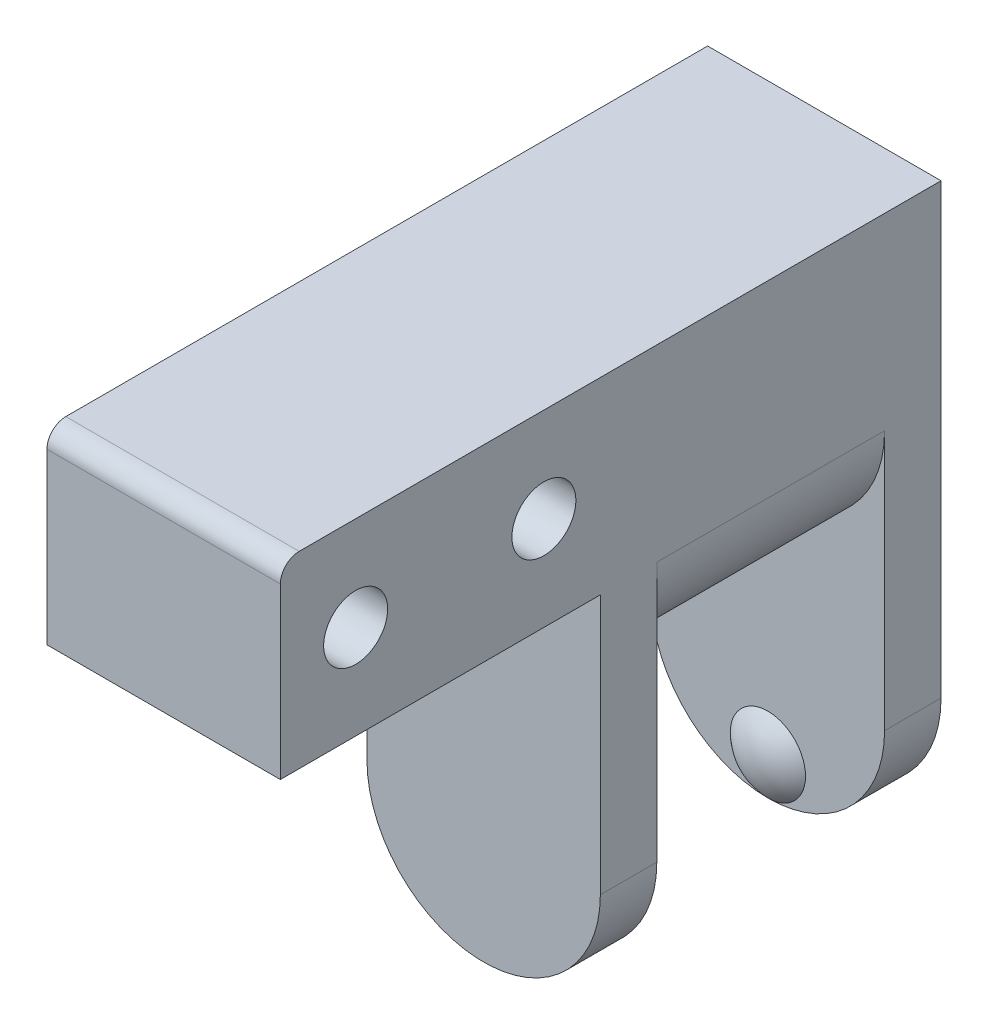
ISO-10303-21;
HEADER;
FILE_DESCRIPTION(('STEP AP214'),'2;1');
FILE_NAME('part.step','',(''),(''),'','','');
FILE_SCHEMA(('AUTOMOTIVE_DESIGN { 1 0 10303 214 1 1 1 1 }'));
ENDSEC;
DATA;
#1=APPLICATION_CONTEXT('core data for automotive mechanical design processes');
#2=APPLICATION_PROTOCOL_DEFINITION('international standard','automotive_design',2000,#1);
#3=PRODUCT_CONTEXT('',#1,'mechanical');
#4=PRODUCT('Part','Part','',(#3));
#5=PRODUCT_RELATED_PRODUCT_CATEGORY('part','',(#4));
#6=PRODUCT_DEFINITION_FORMATION('','',#4);
#7=PRODUCT_DEFINITION_CONTEXT('part definition',#1,'design');
#8=PRODUCT_DEFINITION('design','',#6,#7);
#9=PRODUCT_DEFINITION_SHAPE('','',#8);
#10=(LENGTH_UNIT() NAMED_UNIT(*) SI_UNIT(.MILLI.,.METRE.));
#11=(NAMED_UNIT(*) PLANE_ANGLE_UNIT() SI_UNIT($,.RADIAN.));
#12=(NAMED_UNIT(*) SI_UNIT($,.STERADIAN.) SOLID_ANGLE_UNIT());
#13=UNCERTAINTY_MEASURE_WITH_UNIT(LENGTH_MEASURE(1.E-05),#10,'distance_accuracy_value','');
#14=(GEOMETRIC_REPRESENTATION_CONTEXT(3) GLOBAL_UNCERTAINTY_ASSIGNED_CONTEXT((#13)) GLOBAL_UNIT_ASSIGNED_CONTEXT((#10,
#11,#12)) REPRESENTATION_CONTEXT('',''));
#15=CARTESIAN_POINT('',(0.,0.,0.));
#16=DIRECTION('',(0.,0.,1.));
#17=DIRECTION('',(1.,0.,0.));
#18=AXIS2_PLACEMENT_3D('',#15,#16,#17);
#19=CARTESIAN_POINT('',(12.4,0.,-12.1));
#20=DIRECTION('',(0.,0.,-1.));
#21=DIRECTION('',(0.,1.,0.));
#22=AXIS2_PLACEMENT_3D('',#19,#20,#21);
#23=PLANE('',#22);
#24=CARTESIAN_POINT('',(6.2,-13.8,-12.1));
#25=DIRECTION('',(0.,0.,-1.));
#26=DIRECTION('',(0.,1.,0.));
#27=AXIS2_PLACEMENT_3D('',#24,#25,#26);
#28=CIRCLE('',#27,6.2);
#29=CARTESIAN_POINT('',(0.,-13.8,-12.1));
#30=VERTEX_POINT('',#29);
#31=CARTESIAN_POINT('',(6.2,-20.,-12.1));
#32=VERTEX_POINT('',#31);
#33=EDGE_CURVE('E136',#30,#32,#28,.F.);
#34=ORIENTED_EDGE('',*,*,#33,.T.);
#35=CARTESIAN_POINT('',(6.2,-18.,-12.1));
#36=DIRECTION('',(0.,0.,1.));
#37=DIRECTION('',(1.,0.,0.));
#38=AXIS2_PLACEMENT_3D('',#35,#36,#37);
#39=CIRCLE('',#38,2.);
#40=EDGE_CURVE('E265',#32,#32,#39,.T.);
#41=ORIENTED_EDGE('',*,*,#40,.F.);
#42=CARTESIAN_POINT('',(12.4,-13.8,-12.1));
#43=VERTEX_POINT('',#42);
#44=EDGE_CURVE('E248',#32,#43,#28,.F.);
#45=ORIENTED_EDGE('',*,*,#44,.T.);
#46=DIRECTION('',(0.,-1.,0.));
#47=VECTOR('',#46,1.);
#48=CARTESIAN_POINT('',(12.4,0.,-12.1));
#49=LINE('',#48,#47);
#50=CARTESIAN_POINT('',(12.4,0.,-12.1));
#51=VERTEX_POINT('',#50);
#52=EDGE_CURVE('E177',#51,#43,#49,.T.);
#53=ORIENTED_EDGE('',*,*,#52,.F.);
#54=CARTESIAN_POINT('',(6.2,0.,-12.1));
#55=DIRECTION('',(0.,0.,-1.));
#56=DIRECTION('',(0.,1.,0.));
#57=AXIS2_PLACEMENT_3D('',#54,#55,#56);
#58=CIRCLE('',#57,6.2);
#59=CARTESIAN_POINT('',(0.,0.,-12.1));
#60=VERTEX_POINT('',#59);
#61=EDGE_CURVE('E234',#51,#60,#58,.T.);
#62=ORIENTED_EDGE('',*,*,#61,.T.);
#63=DIRECTION('',(0.,-1.,0.));
#64=VECTOR('',#63,1.);
#65=CARTESIAN_POINT('',(0.,0.,-12.1));
#66=LINE('',#65,#64);
#67=EDGE_CURVE('E155',#60,#30,#66,.T.);
#68=ORIENTED_EDGE('',*,*,#67,.T.);
#69=EDGE_LOOP('',(#34,#41,#45,#53,#62,#68));
#70=FACE_BOUND('',#69,.T.);
#71=ADVANCED_FACE('F42',(#70),#23,.F.);
#72=CARTESIAN_POINT('',(12.4,0.,-15.1));
#73=DIRECTION('',(0.,0.,1.));
#74=DIRECTION('',(0.,-1.,0.));
#75=AXIS2_PLACEMENT_3D('',#72,#73,#74);
#76=PLANE('',#75);
#77=DIRECTION('',(0.,1.,0.));
#78=VECTOR('',#77,1.);
#79=CARTESIAN_POINT('',(12.4,0.,-15.1));
#80=LINE('',#79,#78);
#81=CARTESIAN_POINT('',(12.4,-13.8,-15.1));
#82=VERTEX_POINT('',#81);
#83=CARTESIAN_POINT('',(12.4,10.,-15.1));
#84=VERTEX_POINT('',#83);
#85=EDGE_CURVE('E148',#82,#84,#80,.T.);
#86=ORIENTED_EDGE('',*,*,#85,.F.);
#87=CARTESIAN_POINT('',(6.2,-13.8,-15.1));
#88=DIRECTION('',(0.,0.,-1.));
#89=DIRECTION('',(1.,0.,0.));
#90=AXIS2_PLACEMENT_3D('',#87,#88,#89);
#91=CIRCLE('',#90,6.2);
#92=CARTESIAN_POINT('',(0.,-13.8,-15.1));
#93=VERTEX_POINT('',#92);
#94=EDGE_CURVE('E132',#82,#93,#91,.T.);
#95=ORIENTED_EDGE('',*,*,#94,.T.);
#96=DIRECTION('',(0.,1.,0.));
#97=VECTOR('',#96,1.);
#98=CARTESIAN_POINT('',(0.,0.,-15.1));
#99=LINE('',#98,#97);
#100=CARTESIAN_POINT('',(0.,10.,-15.1));
#101=VERTEX_POINT('',#100);
#102=EDGE_CURVE('E146',#93,#101,#99,.T.);
#103=ORIENTED_EDGE('',*,*,#102,.T.);
#104=DIRECTION('',(-1.,0.,0.));
#105=VECTOR('',#104,1.);
#106=CARTESIAN_POINT('',(12.4,10.,-15.1));
#107=LINE('',#106,#105);
#108=EDGE_CURVE('E187',#84,#101,#107,.T.);
#109=ORIENTED_EDGE('',*,*,#108,.F.);
#110=EDGE_LOOP('',(#86,#95,#103,#109));
#111=FACE_BOUND('',#110,.T.);
#112=ADVANCED_FACE('F144',(#111),#76,.F.);
#113=CARTESIAN_POINT('',(12.4,0.,3.));
#114=DIRECTION('',(0.,0.,-1.));
#115=DIRECTION('',(0.,1.,0.));
#116=AXIS2_PLACEMENT_3D('',#113,#114,#115);
#117=PLANE('',#116);
#118=DIRECTION('',(0.,-1.,0.));
#119=VECTOR('',#118,1.);
#120=CARTESIAN_POINT('',(0.,0.,3.));
#121=LINE('',#120,#119);
#122=CARTESIAN_POINT('',(0.,0.,3.));
#123=VERTEX_POINT('',#122);
#124=CARTESIAN_POINT('',(0.,-13.8,3.));
#125=VERTEX_POINT('',#124);
#126=EDGE_CURVE('E170',#123,#125,#121,.T.);
#127=ORIENTED_EDGE('',*,*,#126,.T.);
#128=CARTESIAN_POINT('',(6.2,-13.8,3.));
#129=DIRECTION('',(0.,0.,-1.));
#130=DIRECTION('',(0.,1.,0.));
#131=AXIS2_PLACEMENT_3D('',#128,#129,#130);
#132=CIRCLE('',#131,6.2);
#133=CARTESIAN_POINT('',(12.4,-13.8,3.));
#134=VERTEX_POINT('',#133);
#135=EDGE_CURVE('E249',#125,#134,#132,.F.);
#136=ORIENTED_EDGE('',*,*,#135,.T.);
#137=DIRECTION('',(0.,-1.,0.));
#138=VECTOR('',#137,1.);
#139=CARTESIAN_POINT('',(12.4,0.,3.));
#140=LINE('',#139,#138);
#141=CARTESIAN_POINT('',(12.4,0.,3.));
#142=VERTEX_POINT('',#141);
#143=EDGE_CURVE('E211',#142,#134,#140,.T.);
#144=ORIENTED_EDGE('',*,*,#143,.F.);
#145=DIRECTION('',(-1.,0.,0.));
#146=VECTOR('',#145,1.);
#147=CARTESIAN_POINT('',(12.4,0.,3.));
#148=LINE('',#147,#146);
#149=EDGE_CURVE('E178',#142,#123,#148,.T.);
#150=ORIENTED_EDGE('',*,*,#149,.T.);
#151=EDGE_LOOP('',(#127,#136,#144,#150));
#152=FACE_BOUND('',#151,.T.);
#153=ADVANCED_FACE('F283',(#152),#117,.F.);
#154=CARTESIAN_POINT('',(12.4,0.,0.));
#155=DIRECTION('',(0.,0.,1.));
#156=DIRECTION('',(1.,0.,0.));
#157=AXIS2_PLACEMENT_3D('',#154,#155,#156);
#158=PLANE('',#157);
#159=DIRECTION('',(0.,1.,0.));
#160=VECTOR('',#159,1.);
#161=CARTESIAN_POINT('',(12.4,0.,0.));
#162=LINE('',#161,#160);
#163=CARTESIAN_POINT('',(12.4,-13.8,0.));
#164=VERTEX_POINT('',#163);
#165=CARTESIAN_POINT('',(12.4,0.,0.));
#166=VERTEX_POINT('',#165);
#167=EDGE_CURVE('E183',#164,#166,#162,.T.);
#168=ORIENTED_EDGE('',*,*,#167,.F.);
#169=CARTESIAN_POINT('',(6.2,-13.8,0.));
#170=DIRECTION('',(0.,0.,1.));
#171=DIRECTION('',(1.,0.,0.));
#172=AXIS2_PLACEMENT_3D('',#169,#170,#171);
#173=CIRCLE('',#172,6.2);
#174=CARTESIAN_POINT('',(0.,-13.8,0.));
#175=VERTEX_POINT('',#174);
#176=EDGE_CURVE('E252',#164,#175,#173,.F.);
#177=ORIENTED_EDGE('',*,*,#176,.T.);
#178=DIRECTION('',(0.,1.,0.));
#179=VECTOR('',#178,1.);
#180=CARTESIAN_POINT('',(0.,0.,0.));
#181=LINE('',#180,#179);
#182=CARTESIAN_POINT('',(0.,0.,0.));
#183=VERTEX_POINT('',#182);
#184=EDGE_CURVE('E174',#175,#183,#181,.T.);
#185=ORIENTED_EDGE('',*,*,#184,.T.);
#186=CARTESIAN_POINT('',(6.2,0.,0.));
#187=DIRECTION('',(0.,0.,-1.));
#188=DIRECTION('',(1.,0.,0.));
#189=AXIS2_PLACEMENT_3D('',#186,#187,#188);
#190=CIRCLE('',#189,6.2);
#191=EDGE_CURVE('E239',#166,#183,#190,.T.);
#192=ORIENTED_EDGE('',*,*,#191,.F.);
#193=EDGE_LOOP('',(#168,#177,#185,#192));
#194=FACE_BOUND('',#193,.T.);
#195=ADVANCED_FACE('F288',(#194),#158,.F.);
#196=CARTESIAN_POINT('',(12.4,10.,0.));
#197=DIRECTION('',(0.,-1.,0.));
#198=DIRECTION('',(0.,0.,-1.));
#199=AXIS2_PLACEMENT_3D('',#196,#197,#198);
#200=PLANE('',#199);
#201=DIRECTION('',(0.,0.,1.));
#202=VECTOR('',#201,1.);
#203=CARTESIAN_POINT('',(0.,10.,0.));
#204=LINE('',#203,#202);
#205=CARTESIAN_POINT('',(0.,9.99999999999999,19.));
#206=VERTEX_POINT('',#205);
#207=EDGE_CURVE('E153',#101,#206,#204,.T.);
#208=ORIENTED_EDGE('',*,*,#207,.T.);
#209=DIRECTION('',(-1.,0.,0.));
#210=VECTOR('',#209,1.);
#211=CARTESIAN_POINT('',(12.4,9.99999999999999,19.));
#212=LINE('',#211,#210);
#213=CARTESIAN_POINT('',(12.4,9.99999999999999,19.));
#214=VERTEX_POINT('',#213);
#215=EDGE_CURVE('E51',#206,#214,#212,.F.);
#216=ORIENTED_EDGE('',*,*,#215,.T.);
#217=DIRECTION('',(0.,0.,1.));
#218=VECTOR('',#217,1.);
#219=CARTESIAN_POINT('',(12.4,10.,0.));
#220=LINE('',#219,#218);
#221=EDGE_CURVE('E220',#84,#214,#220,.T.);
#222=ORIENTED_EDGE('',*,*,#221,.F.);
#223=ORIENTED_EDGE('',*,*,#108,.T.);
#224=EDGE_LOOP('',(#208,#216,#222,#223));
#225=FACE_BOUND('',#224,.T.);
#226=ADVANCED_FACE('F313',(#225),#200,.F.);
#227=CARTESIAN_POINT('',(12.4,0.,20.));
#228=DIRECTION('',(0.,0.,-1.));
#229=DIRECTION('',(0.,1.,0.));
#230=AXIS2_PLACEMENT_3D('',#227,#228,#229);
#231=PLANE('',#230);
#232=DIRECTION('',(0.,-1.,0.));
#233=VECTOR('',#232,1.);
#234=CARTESIAN_POINT('',(12.4,0.,20.));
#235=LINE('',#234,#233);
#236=CARTESIAN_POINT('',(12.4,8.99999999999999,20.));
#237=VERTEX_POINT('',#236);
#238=CARTESIAN_POINT('',(12.4,0.,20.));
#239=VERTEX_POINT('',#238);
#240=EDGE_CURVE('E217',#237,#239,#235,.T.);
#241=ORIENTED_EDGE('',*,*,#240,.F.);
#242=DIRECTION('',(-1.,0.,0.));
#243=VECTOR('',#242,1.);
#244=CARTESIAN_POINT('',(12.4,8.99999999999999,20.));
#245=LINE('',#244,#243);
#246=CARTESIAN_POINT('',(0.,8.99999999999999,20.));
#247=VERTEX_POINT('',#246);
#248=EDGE_CURVE('E194',#237,#247,#245,.T.);
#249=ORIENTED_EDGE('',*,*,#248,.T.);
#250=DIRECTION('',(0.,-1.,0.));
#251=VECTOR('',#250,1.);
#252=CARTESIAN_POINT('',(0.,0.,20.));
#253=LINE('',#252,#251);
#254=CARTESIAN_POINT('',(0.,0.,20.));
#255=VERTEX_POINT('',#254);
#256=EDGE_CURVE('E159',#247,#255,#253,.T.);
#257=ORIENTED_EDGE('',*,*,#256,.T.);
#258=DIRECTION('',(-1.,0.,0.));
#259=VECTOR('',#258,1.);
#260=CARTESIAN_POINT('',(12.4,0.,20.));
#261=LINE('',#260,#259);
#262=EDGE_CURVE('E182',#239,#255,#261,.T.);
#263=ORIENTED_EDGE('',*,*,#262,.F.);
#264=EDGE_LOOP('',(#241,#249,#257,#263));
#265=FACE_BOUND('',#264,.T.);
#266=ADVANCED_FACE('F316',(#265),#231,.F.);
#267=CARTESIAN_POINT('',(12.4,0.,0.));
#268=DIRECTION('',(0.,1.,0.));
#269=DIRECTION('',(0.,0.,1.));
#270=AXIS2_PLACEMENT_3D('',#267,#268,#269);
#271=PLANE('',#270);
#272=DIRECTION('',(0.,0.,-1.));
#273=VECTOR('',#272,1.);
#274=CARTESIAN_POINT('',(0.,0.,0.));
#275=LINE('',#274,#273);
#276=EDGE_CURVE('E167',#255,#123,#275,.T.);
#277=ORIENTED_EDGE('',*,*,#276,.T.);
#278=ORIENTED_EDGE('',*,*,#149,.F.);
#279=DIRECTION('',(0.,0.,-1.));
#280=VECTOR('',#279,1.);
#281=CARTESIAN_POINT('',(12.4,0.,0.));
#282=LINE('',#281,#280);
#283=EDGE_CURVE('E214',#239,#142,#282,.T.);
#284=ORIENTED_EDGE('',*,*,#283,.F.);
#285=ORIENTED_EDGE('',*,*,#262,.T.);
#286=EDGE_LOOP('',(#277,#278,#284,#285));
#287=FACE_BOUND('',#286,.T.);
#288=ADVANCED_FACE('F319',(#287),#271,.F.);
#289=CARTESIAN_POINT('',(12.4,0.,0.));
#290=DIRECTION('',(1.,0.,0.));
#291=DIRECTION('',(0.,0.,-1.));
#292=AXIS2_PLACEMENT_3D('',#289,#290,#291);
#293=PLANE('',#292);
#294=CARTESIAN_POINT('',(12.4,4.99999999999999,6.));
#295=DIRECTION('',(1.,0.,0.));
#296=DIRECTION('',(0.,0.,-1.));
#297=AXIS2_PLACEMENT_3D('',#294,#295,#296);
#298=CIRCLE('',#297,1.7);
#299=CARTESIAN_POINT('',(12.4,4.99999999999999,4.3));
#300=VERTEX_POINT('',#299);
#301=EDGE_CURVE('E203',#300,#300,#298,.T.);
#302=ORIENTED_EDGE('',*,*,#301,.F.);
#303=EDGE_LOOP('',(#302));
#304=FACE_BOUND('',#303,.T.);
#305=CARTESIAN_POINT('',(12.4,4.99999999999999,16.));
#306=DIRECTION('',(1.,0.,0.));
#307=DIRECTION('',(0.,0.,-1.));
#308=AXIS2_PLACEMENT_3D('',#305,#306,#307);
#309=CIRCLE('',#308,1.7);
#310=CARTESIAN_POINT('',(12.4,4.99999999999999,14.3));
#311=VERTEX_POINT('',#310);
#312=EDGE_CURVE('E198',#311,#311,#309,.T.);
#313=ORIENTED_EDGE('',*,*,#312,.F.);
#314=EDGE_LOOP('',(#313));
#315=FACE_BOUND('',#314,.T.);
#316=ORIENTED_EDGE('',*,*,#221,.T.);
#317=CARTESIAN_POINT('',(12.4,8.99999999999999,19.));
#318=DIRECTION('',(1.,0.,0.));
#319=DIRECTION('',(0.,0.,-1.));
#320=AXIS2_PLACEMENT_3D('',#317,#318,#319);
#321=CIRCLE('',#320,1.);
#322=EDGE_CURVE('E11',#214,#237,#321,.T.);
#323=ORIENTED_EDGE('',*,*,#322,.T.);
#324=ORIENTED_EDGE('',*,*,#240,.T.);
#325=ORIENTED_EDGE('',*,*,#283,.T.);
#326=ORIENTED_EDGE('',*,*,#143,.T.);
#327=DIRECTION('',(0.,0.,1.));
#328=VECTOR('',#327,1.);
#329=CARTESIAN_POINT('',(12.4,-13.8,-15.1));
#330=LINE('',#329,#328);
#331=EDGE_CURVE('E140',#164,#134,#330,.T.);
#332=ORIENTED_EDGE('',*,*,#331,.F.);
#333=ORIENTED_EDGE('',*,*,#167,.T.);
#334=DIRECTION('',(0.,0.,1.));
#335=VECTOR('',#334,1.);
#336=CARTESIAN_POINT('',(12.4,0.,-35.5130263801639));
#337=LINE('',#336,#335);
#338=EDGE_CURVE('E235',#51,#166,#337,.T.);
#339=ORIENTED_EDGE('',*,*,#338,.F.);
#340=ORIENTED_EDGE('',*,*,#52,.T.);
#341=EDGE_CURVE('E255',#82,#43,#330,.T.);
#342=ORIENTED_EDGE('',*,*,#341,.F.);
#343=ORIENTED_EDGE('',*,*,#85,.T.);
#344=EDGE_LOOP('',(#316,#323,#324,#325,#326,#332,#333,#339,#340,#342,#343));
#345=FACE_BOUND('',#344,.T.);
#346=ADVANCED_FACE('F279',(#304,#315,#345),#293,.T.);
#347=CARTESIAN_POINT('',(0.,0.,0.));
#348=DIRECTION('',(1.,0.,0.));
#349=DIRECTION('',(0.,0.,-1.));
#350=AXIS2_PLACEMENT_3D('',#347,#348,#349);
#351=PLANE('',#350);
#352=CARTESIAN_POINT('',(0.,4.99999999999999,6.));
#353=DIRECTION('',(1.,0.,0.));
#354=DIRECTION('',(0.,0.,-1.));
#355=AXIS2_PLACEMENT_3D('',#352,#353,#354);
#356=CIRCLE('',#355,1.7);
#357=CARTESIAN_POINT('',(0.,4.99999999999999,4.3));
#358=VERTEX_POINT('',#357);
#359=EDGE_CURVE('E199',#358,#358,#356,.T.);
#360=ORIENTED_EDGE('',*,*,#359,.T.);
#361=EDGE_LOOP('',(#360));
#362=FACE_BOUND('',#361,.T.);
#363=CARTESIAN_POINT('',(0.,4.99999999999999,16.));
#364=DIRECTION('',(1.,0.,0.));
#365=DIRECTION('',(0.,0.,-1.));
#366=AXIS2_PLACEMENT_3D('',#363,#364,#365);
#367=CIRCLE('',#366,1.7);
#368=CARTESIAN_POINT('',(0.,4.99999999999999,14.3));
#369=VERTEX_POINT('',#368);
#370=EDGE_CURVE('E150',#369,#369,#367,.T.);
#371=ORIENTED_EDGE('',*,*,#370,.T.);
#372=EDGE_LOOP('',(#371));
#373=FACE_BOUND('',#372,.T.);
#374=ORIENTED_EDGE('',*,*,#256,.F.);
#375=CARTESIAN_POINT('',(0.,8.99999999999999,19.));
#376=DIRECTION('',(1.,0.,0.));
#377=DIRECTION('',(0.,0.,-1.));
#378=AXIS2_PLACEMENT_3D('',#375,#376,#377);
#379=CIRCLE('',#378,1.);
#380=EDGE_CURVE('E65',#247,#206,#379,.F.);
#381=ORIENTED_EDGE('',*,*,#380,.T.);
#382=ORIENTED_EDGE('',*,*,#207,.F.);
#383=ORIENTED_EDGE('',*,*,#102,.F.);
#384=DIRECTION('',(0.,0.,1.));
#385=VECTOR('',#384,1.);
#386=CARTESIAN_POINT('',(0.,-13.8,-15.1));
#387=LINE('',#386,#385);
#388=EDGE_CURVE('E128',#93,#30,#387,.T.);
#389=ORIENTED_EDGE('',*,*,#388,.T.);
#390=ORIENTED_EDGE('',*,*,#67,.F.);
#391=DIRECTION('',(0.,0.,1.));
#392=VECTOR('',#391,1.);
#393=CARTESIAN_POINT('',(0.,0.,-35.5130263801639));
#394=LINE('',#393,#392);
#395=EDGE_CURVE('E161',#60,#183,#394,.T.);
#396=ORIENTED_EDGE('',*,*,#395,.T.);
#397=ORIENTED_EDGE('',*,*,#184,.F.);
#398=DIRECTION('',(0.,0.,1.));
#399=VECTOR('',#398,1.);
#400=CARTESIAN_POINT('',(0.,-13.8,0.));
#401=LINE('',#400,#399);
#402=EDGE_CURVE('E190',#175,#125,#401,.T.);
#403=ORIENTED_EDGE('',*,*,#402,.T.);
#404=ORIENTED_EDGE('',*,*,#126,.F.);
#405=ORIENTED_EDGE('',*,*,#276,.F.);
#406=EDGE_LOOP('',(#374,#381,#382,#383,#389,#390,#396,#397,#403,#404,#405));
#407=FACE_BOUND('',#406,.T.);
#408=ADVANCED_FACE('F152',(#362,#373,#407),#351,.F.);
#409=CARTESIAN_POINT('',(6.2,0.,-35.5130263801639));
#410=DIRECTION('',(0.,0.,1.));
#411=DIRECTION('',(1.,0.,0.));
#412=AXIS2_PLACEMENT_3D('',#409,#410,#411);
#413=CYLINDRICAL_SURFACE('',#412,6.2);
#414=ORIENTED_EDGE('',*,*,#338,.T.);
#415=ORIENTED_EDGE('',*,*,#191,.T.);
#416=ORIENTED_EDGE('',*,*,#395,.F.);
#417=ORIENTED_EDGE('',*,*,#61,.F.);
#418=EDGE_LOOP('',(#414,#415,#416,#417));
#419=FACE_BOUND('',#418,.T.);
#420=ADVANCED_FACE('F292',(#419),#413,.T.);
#421=CARTESIAN_POINT('',(6.2,-13.8,-15.1));
#422=DIRECTION('',(0.,0.,1.));
#423=DIRECTION('',(1.,0.,0.));
#424=AXIS2_PLACEMENT_3D('',#421,#422,#423);
#425=CYLINDRICAL_SURFACE('',#424,6.2);
#426=ORIENTED_EDGE('',*,*,#402,.F.);
#427=ORIENTED_EDGE('',*,*,#176,.F.);
#428=ORIENTED_EDGE('',*,*,#331,.T.);
#429=ORIENTED_EDGE('',*,*,#135,.F.);
#430=EDGE_LOOP('',(#426,#427,#428,#429));
#431=FACE_BOUND('',#430,.T.);
#432=ADVANCED_FACE('F276',(#431),#425,.T.);
#433=ORIENTED_EDGE('',*,*,#388,.F.);
#434=ORIENTED_EDGE('',*,*,#94,.F.);
#435=ORIENTED_EDGE('',*,*,#341,.T.);
#436=ORIENTED_EDGE('',*,*,#44,.F.);
#437=ORIENTED_EDGE('',*,*,#33,.F.);
#438=EDGE_LOOP('',(#433,#434,#435,#436,#437));
#439=FACE_BOUND('',#438,.T.);
#440=ADVANCED_FACE('F130',(#439),#425,.T.);
#441=CARTESIAN_POINT('',(12.4,4.99999999999999,16.));
#442=DIRECTION('',(1.,0.,0.));
#443=DIRECTION('',(0.,0.,-1.));
#444=AXIS2_PLACEMENT_3D('',#441,#442,#443);
#445=CYLINDRICAL_SURFACE('',#444,1.7);
#446=ORIENTED_EDGE('',*,*,#312,.T.);
#447=EDGE_LOOP('',(#446));
#448=FACE_BOUND('',#447,.T.);
#449=ORIENTED_EDGE('',*,*,#370,.F.);
#450=EDGE_LOOP('',(#449));
#451=FACE_BOUND('',#450,.T.);
#452=ADVANCED_FACE('F335',(#448,#451),#445,.F.);
#453=CARTESIAN_POINT('',(12.4,4.99999999999999,6.));
#454=DIRECTION('',(1.,0.,0.));
#455=DIRECTION('',(0.,0.,-1.));
#456=AXIS2_PLACEMENT_3D('',#453,#454,#455);
#457=CYLINDRICAL_SURFACE('',#456,1.7);
#458=ORIENTED_EDGE('',*,*,#301,.T.);
#459=EDGE_LOOP('',(#458));
#460=FACE_BOUND('',#459,.T.);
#461=ORIENTED_EDGE('',*,*,#359,.F.);
#462=EDGE_LOOP('',(#461));
#463=FACE_BOUND('',#462,.T.);
#464=ADVANCED_FACE('F338',(#460,#463),#457,.F.);
#465=CARTESIAN_POINT('',(6.2,-18.,-14.2));
#466=DIRECTION('',(0.,0.,1.));
#467=DIRECTION('',(0.,1.,0.));
#468=AXIS2_PLACEMENT_3D('',#465,#466,#467);
#469=SPHERICAL_SURFACE('',#468,2.89999999999999);
#470=ORIENTED_EDGE('',*,*,#40,.T.);
#471=EDGE_LOOP('',(#470));
#472=FACE_BOUND('',#471,.T.);
#473=ADVANCED_FACE('F269',(#472),#469,.T.);
#474=CARTESIAN_POINT('',(12.4,8.99999999999999,19.));
#475=DIRECTION('',(-1.,0.,0.));
#476=DIRECTION('',(0.,0.,1.));
#477=AXIS2_PLACEMENT_3D('',#474,#475,#476);
#478=CYLINDRICAL_SURFACE('',#477,1.);
#479=ORIENTED_EDGE('',*,*,#322,.F.);
#480=ORIENTED_EDGE('',*,*,#215,.F.);
#481=ORIENTED_EDGE('',*,*,#380,.F.);
#482=ORIENTED_EDGE('',*,*,#248,.F.);
#483=EDGE_LOOP('',(#479,#480,#481,#482));
#484=FACE_BOUND('',#483,.T.);
#485=ADVANCED_FACE('F44',(#484),#478,.T.);
#486=CLOSED_SHELL('',(#71,#112,#153,#195,#226,#266,#288,#346,#408,#420,#432,#440,#452,#464,#473,#485));
#487=MANIFOLD_SOLID_BREP('B2',#486);
#488=ADVANCED_BREP_SHAPE_REPRESENTATION('',(#18,#487),#14);
#489=SHAPE_DEFINITION_REPRESENTATION(#9,#488);
ENDSEC;
END-ISO-10303-21;
